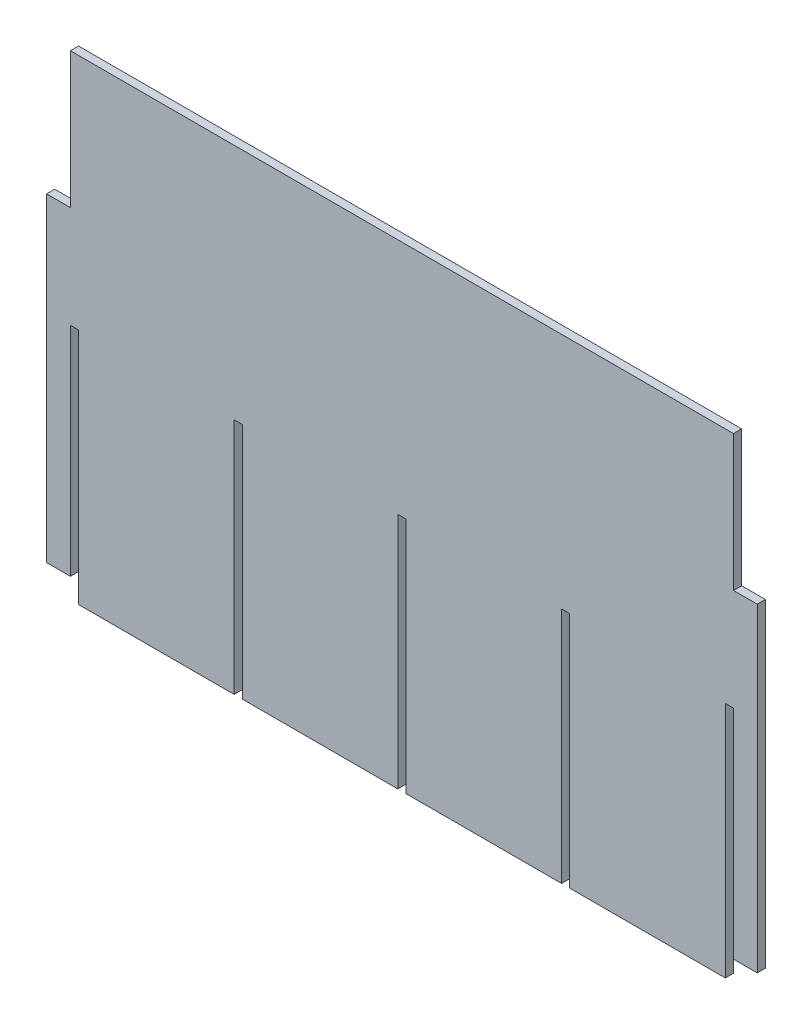
ISO-10303-21;
HEADER;
FILE_DESCRIPTION(('STEP AP214'),'2;1');
FILE_NAME('part.step','',(''),(''),'','','');
FILE_SCHEMA(('AUTOMOTIVE_DESIGN { 1 0 10303 214 1 1 1 1 }'));
ENDSEC;
DATA;
#1=APPLICATION_CONTEXT('core data for automotive mechanical design processes');
#2=APPLICATION_PROTOCOL_DEFINITION('international standard','automotive_design',2000,#1);
#3=PRODUCT_CONTEXT('',#1,'mechanical');
#4=PRODUCT('Part','Part','',(#3));
#5=PRODUCT_RELATED_PRODUCT_CATEGORY('part','',(#4));
#6=PRODUCT_DEFINITION_FORMATION('','',#4);
#7=PRODUCT_DEFINITION_CONTEXT('part definition',#1,'design');
#8=PRODUCT_DEFINITION('design','',#6,#7);
#9=PRODUCT_DEFINITION_SHAPE('','',#8);
#10=(LENGTH_UNIT() NAMED_UNIT(*) SI_UNIT(.MILLI.,.METRE.));
#11=(NAMED_UNIT(*) PLANE_ANGLE_UNIT() SI_UNIT($,.RADIAN.));
#12=(NAMED_UNIT(*) SI_UNIT($,.STERADIAN.) SOLID_ANGLE_UNIT());
#13=UNCERTAINTY_MEASURE_WITH_UNIT(LENGTH_MEASURE(1.E-05),#10,'distance_accuracy_value','');
#14=(GEOMETRIC_REPRESENTATION_CONTEXT(3) GLOBAL_UNCERTAINTY_ASSIGNED_CONTEXT((#13)) GLOBAL_UNIT_ASSIGNED_CONTEXT((#10,
#11,#12)) REPRESENTATION_CONTEXT('',''));
#15=CARTESIAN_POINT('',(0.,0.,0.));
#16=DIRECTION('',(0.,0.,1.));
#17=DIRECTION('',(1.,0.,0.));
#18=AXIS2_PLACEMENT_3D('',#15,#16,#17);
#19=CARTESIAN_POINT('',(-24.7000000000002,32.,0.600000000000572));
#20=DIRECTION('',(0.,1.,0.));
#21=DIRECTION('',(0.,0.,1.));
#22=AXIS2_PLACEMENT_3D('',#19,#20,#21);
#23=PLANE('',#22);
#24=DIRECTION('',(1.,0.,0.));
#25=VECTOR('',#24,1.);
#26=CARTESIAN_POINT('',(-24.7000000000002,32.,-0.599999999999434));
#27=LINE('',#26,#25);
#28=CARTESIAN_POINT('',(-24.7000000000002,32.,-0.599999999999434));
#29=VERTEX_POINT('',#28);
#30=CARTESIAN_POINT('',(-23.5000000000002,32.,-0.599999999999434));
#31=VERTEX_POINT('',#30);
#32=EDGE_CURVE('E262',#29,#31,#27,.T.);
#33=ORIENTED_EDGE('',*,*,#32,.T.);
#34=DIRECTION('',(0.,0.,-1.));
#35=VECTOR('',#34,1.);
#36=CARTESIAN_POINT('',(-23.5000000000002,32.,0.600000000000572));
#37=LINE('',#36,#35);
#38=CARTESIAN_POINT('',(-23.5000000000002,32.,0.600000000000572));
#39=VERTEX_POINT('',#38);
#40=EDGE_CURVE('E11',#39,#31,#37,.T.);
#41=ORIENTED_EDGE('',*,*,#40,.F.);
#42=DIRECTION('',(1.,0.,0.));
#43=VECTOR('',#42,1.);
#44=CARTESIAN_POINT('',(-24.7000000000002,32.,0.600000000000572));
#45=LINE('',#44,#43);
#46=CARTESIAN_POINT('',(-24.7000000000002,32.,0.600000000000572));
#47=VERTEX_POINT('',#46);
#48=EDGE_CURVE('E344',#47,#39,#45,.T.);
#49=ORIENTED_EDGE('',*,*,#48,.F.);
#50=DIRECTION('',(0.,0.,-1.));
#51=VECTOR('',#50,1.);
#52=CARTESIAN_POINT('',(-24.7000000000002,32.,0.600000000000572));
#53=LINE('',#52,#51);
#54=EDGE_CURVE('E258',#47,#29,#53,.T.);
#55=ORIENTED_EDGE('',*,*,#54,.T.);
#56=EDGE_LOOP('',(#33,#41,#49,#55));
#57=FACE_BOUND('',#56,.T.);
#58=ADVANCED_FACE('F40',(#57),#23,.F.);
#59=CARTESIAN_POINT('',(-23.5000000000002,32.,0.600000000000572));
#60=DIRECTION('',(1.,0.,0.));
#61=DIRECTION('',(0.,1.,0.));
#62=AXIS2_PLACEMENT_3D('',#59,#60,#61);
#63=PLANE('',#62);
#64=DIRECTION('',(0.,-1.,0.));
#65=VECTOR('',#64,1.);
#66=CARTESIAN_POINT('',(-23.5000000000002,32.,-0.599999999999434));
#67=LINE('',#66,#65);
#68=CARTESIAN_POINT('',(-23.5000000000002,-3.,-0.599999999999989));
#69=VERTEX_POINT('',#68);
#70=EDGE_CURVE('E266',#31,#69,#67,.T.);
#71=ORIENTED_EDGE('',*,*,#70,.T.);
#72=DIRECTION('',(0.,0.,-1.));
#73=VECTOR('',#72,1.);
#74=CARTESIAN_POINT('',(-23.5000000000002,-3.,0.599999999999989));
#75=LINE('',#74,#73);
#76=CARTESIAN_POINT('',(-23.5000000000002,-3.,0.599999999999989));
#77=VERTEX_POINT('',#76);
#78=EDGE_CURVE('E49',#77,#69,#75,.T.);
#79=ORIENTED_EDGE('',*,*,#78,.F.);
#80=DIRECTION('',(0.,-1.,0.));
#81=VECTOR('',#80,1.);
#82=CARTESIAN_POINT('',(-23.5000000000002,32.,0.600000000000572));
#83=LINE('',#82,#81);
#84=EDGE_CURVE('E160',#39,#77,#83,.T.);
#85=ORIENTED_EDGE('',*,*,#84,.F.);
#86=ORIENTED_EDGE('',*,*,#40,.T.);
#87=EDGE_LOOP('',(#71,#79,#85,#86));
#88=FACE_BOUND('',#87,.T.);
#89=ADVANCED_FACE('F541',(#88),#63,.F.);
#90=CARTESIAN_POINT('',(-23.5000000000002,-3.,0.599999999999989));
#91=DIRECTION('',(0.,1.,0.));
#92=DIRECTION('',(-1.,0.,0.));
#93=AXIS2_PLACEMENT_3D('',#90,#91,#92);
#94=PLANE('',#93);
#95=DIRECTION('',(1.,0.,0.));
#96=VECTOR('',#95,1.);
#97=CARTESIAN_POINT('',(-23.5000000000002,-3.,-0.599999999999989));
#98=LINE('',#97,#96);
#99=CARTESIAN_POINT('',(-0.6,-3.,-0.599999999999989));
#100=VERTEX_POINT('',#99);
#101=EDGE_CURVE('E269',#69,#100,#98,.T.);
#102=ORIENTED_EDGE('',*,*,#101,.T.);
#103=DIRECTION('',(0.,0.,-1.));
#104=VECTOR('',#103,1.);
#105=CARTESIAN_POINT('',(-0.6,-3.,0.599999999999989));
#106=LINE('',#105,#104);
#107=CARTESIAN_POINT('',(-0.6,-3.,0.599999999999989));
#108=VERTEX_POINT('',#107);
#109=EDGE_CURVE('E435',#108,#100,#106,.T.);
#110=ORIENTED_EDGE('',*,*,#109,.F.);
#111=DIRECTION('',(1.,0.,0.));
#112=VECTOR('',#111,1.);
#113=CARTESIAN_POINT('',(-23.5000000000002,-3.,0.599999999999989));
#114=LINE('',#113,#112);
#115=EDGE_CURVE('E447',#77,#108,#114,.T.);
#116=ORIENTED_EDGE('',*,*,#115,.F.);
#117=ORIENTED_EDGE('',*,*,#78,.T.);
#118=EDGE_LOOP('',(#102,#110,#116,#117));
#119=FACE_BOUND('',#118,.T.);
#120=ADVANCED_FACE('F445',(#119),#94,.F.);
#121=CARTESIAN_POINT('',(-0.6,-3.,0.599999999999989));
#122=DIRECTION('',(-1.,0.,0.));
#123=DIRECTION('',(0.,-1.,0.));
#124=AXIS2_PLACEMENT_3D('',#121,#122,#123);
#125=PLANE('',#124);
#126=DIRECTION('',(0.,1.,0.));
#127=VECTOR('',#126,1.);
#128=CARTESIAN_POINT('',(-0.6,-3.,-0.599999999999989));
#129=LINE('',#128,#127);
#130=CARTESIAN_POINT('',(-0.6,32.,-0.599999999999407));
#131=VERTEX_POINT('',#130);
#132=EDGE_CURVE('E272',#100,#131,#129,.T.);
#133=ORIENTED_EDGE('',*,*,#132,.T.);
#134=DIRECTION('',(0.,0.,-1.));
#135=VECTOR('',#134,1.);
#136=CARTESIAN_POINT('',(-0.6,32.,0.600000000000572));
#137=LINE('',#136,#135);
#138=CARTESIAN_POINT('',(-0.6,32.,0.600000000000572));
#139=VERTEX_POINT('',#138);
#140=EDGE_CURVE('E431',#139,#131,#137,.T.);
#141=ORIENTED_EDGE('',*,*,#140,.F.);
#142=DIRECTION('',(0.,1.,0.));
#143=VECTOR('',#142,1.);
#144=CARTESIAN_POINT('',(-0.6,-3.,0.599999999999989));
#145=LINE('',#144,#143);
#146=EDGE_CURVE('E465',#108,#139,#145,.T.);
#147=ORIENTED_EDGE('',*,*,#146,.F.);
#148=ORIENTED_EDGE('',*,*,#109,.T.);
#149=EDGE_LOOP('',(#133,#141,#147,#148));
#150=FACE_BOUND('',#149,.T.);
#151=ADVANCED_FACE('F456',(#150),#125,.F.);
#152=CARTESIAN_POINT('',(-0.6,32.,0.600000000000572));
#153=DIRECTION('',(0.,1.,0.));
#154=DIRECTION('',(0.,0.,1.));
#155=AXIS2_PLACEMENT_3D('',#152,#153,#154);
#156=PLANE('',#155);
#157=DIRECTION('',(1.,0.,0.));
#158=VECTOR('',#157,1.);
#159=CARTESIAN_POINT('',(-0.6,32.,-0.599999999999407));
#160=LINE('',#159,#158);
#161=CARTESIAN_POINT('',(0.600000000000002,32.,-0.599999999999407));
#162=VERTEX_POINT('',#161);
#163=EDGE_CURVE('E275',#131,#162,#160,.T.);
#164=ORIENTED_EDGE('',*,*,#163,.T.);
#165=DIRECTION('',(0.,0.,-1.));
#166=VECTOR('',#165,1.);
#167=CARTESIAN_POINT('',(0.599999999999998,32.,0.600000000000572));
#168=LINE('',#167,#166);
#169=CARTESIAN_POINT('',(0.599999999999998,32.,0.600000000000572));
#170=VERTEX_POINT('',#169);
#171=EDGE_CURVE('E427',#170,#162,#168,.T.);
#172=ORIENTED_EDGE('',*,*,#171,.F.);
#173=DIRECTION('',(1.,0.,0.));
#174=VECTOR('',#173,1.);
#175=CARTESIAN_POINT('',(-0.6,32.,0.600000000000572));
#176=LINE('',#175,#174);
#177=EDGE_CURVE('E462',#139,#170,#176,.T.);
#178=ORIENTED_EDGE('',*,*,#177,.F.);
#179=ORIENTED_EDGE('',*,*,#140,.T.);
#180=EDGE_LOOP('',(#164,#172,#178,#179));
#181=FACE_BOUND('',#180,.T.);
#182=ADVANCED_FACE('F460',(#181),#156,.F.);
#183=CARTESIAN_POINT('',(0.599999999999998,32.,0.600000000000572));
#184=DIRECTION('',(1.,0.,0.));
#185=DIRECTION('',(0.,1.,0.));
#186=AXIS2_PLACEMENT_3D('',#183,#184,#185);
#187=PLANE('',#186);
#188=DIRECTION('',(0.,-1.,0.));
#189=VECTOR('',#188,1.);
#190=CARTESIAN_POINT('',(0.600000000000002,32.,-0.599999999999407));
#191=LINE('',#190,#189);
#192=CARTESIAN_POINT('',(0.599999999999998,-2.99999999999995,-0.599999999999989));
#193=VERTEX_POINT('',#192);
#194=EDGE_CURVE('E278',#162,#193,#191,.T.);
#195=ORIENTED_EDGE('',*,*,#194,.T.);
#196=DIRECTION('',(0.,0.,-1.));
#197=VECTOR('',#196,1.);
#198=CARTESIAN_POINT('',(0.599999999999994,-2.99999999999995,0.599999999999989));
#199=LINE('',#198,#197);
#200=CARTESIAN_POINT('',(0.599999999999994,-2.99999999999995,0.599999999999989));
#201=VERTEX_POINT('',#200);
#202=EDGE_CURVE('E423',#201,#193,#199,.T.);
#203=ORIENTED_EDGE('',*,*,#202,.F.);
#204=DIRECTION('',(0.,-1.,0.));
#205=VECTOR('',#204,1.);
#206=CARTESIAN_POINT('',(0.599999999999998,32.,0.600000000000572));
#207=LINE('',#206,#205);
#208=EDGE_CURVE('E464',#170,#201,#207,.T.);
#209=ORIENTED_EDGE('',*,*,#208,.F.);
#210=ORIENTED_EDGE('',*,*,#171,.T.);
#211=EDGE_LOOP('',(#195,#203,#209,#210));
#212=FACE_BOUND('',#211,.T.);
#213=ADVANCED_FACE('F553',(#212),#187,.F.);
#214=CARTESIAN_POINT('',(0.599999999999994,-2.99999999999995,0.599999999999989));
#215=DIRECTION('',(0.,1.,0.));
#216=DIRECTION('',(-1.,0.,0.));
#217=AXIS2_PLACEMENT_3D('',#214,#215,#216);
#218=PLANE('',#217);
#219=DIRECTION('',(1.,0.,0.));
#220=VECTOR('',#219,1.);
#221=CARTESIAN_POINT('',(0.599999999999998,-2.99999999999995,-0.599999999999989));
#222=LINE('',#221,#220);
#223=CARTESIAN_POINT('',(23.4999999999999,-3.,-0.599999999999989));
#224=VERTEX_POINT('',#223);
#225=EDGE_CURVE('E281',#193,#224,#222,.T.);
#226=ORIENTED_EDGE('',*,*,#225,.T.);
#227=DIRECTION('',(0.,0.,-1.));
#228=VECTOR('',#227,1.);
#229=CARTESIAN_POINT('',(23.4999999999999,-3.,0.599999999999989));
#230=LINE('',#229,#228);
#231=CARTESIAN_POINT('',(23.4999999999999,-3.,0.599999999999989));
#232=VERTEX_POINT('',#231);
#233=EDGE_CURVE('E419',#232,#224,#230,.T.);
#234=ORIENTED_EDGE('',*,*,#233,.F.);
#235=DIRECTION('',(1.,0.,0.));
#236=VECTOR('',#235,1.);
#237=CARTESIAN_POINT('',(0.599999999999994,-2.99999999999995,0.599999999999989));
#238=LINE('',#237,#236);
#239=EDGE_CURVE('E469',#201,#232,#238,.T.);
#240=ORIENTED_EDGE('',*,*,#239,.F.);
#241=ORIENTED_EDGE('',*,*,#202,.T.);
#242=EDGE_LOOP('',(#226,#234,#240,#241));
#243=FACE_BOUND('',#242,.T.);
#244=ADVANCED_FACE('F556',(#243),#218,.F.);
#245=CARTESIAN_POINT('',(23.4999999999999,-3.,0.599999999999989));
#246=DIRECTION('',(-1.,0.,0.));
#247=DIRECTION('',(0.,-1.,0.));
#248=AXIS2_PLACEMENT_3D('',#245,#246,#247);
#249=PLANE('',#248);
#250=DIRECTION('',(0.,1.,0.));
#251=VECTOR('',#250,1.);
#252=CARTESIAN_POINT('',(23.4999999999999,-3.,-0.599999999999989));
#253=LINE('',#252,#251);
#254=CARTESIAN_POINT('',(23.4999999999999,32.,-0.599999999999407));
#255=VERTEX_POINT('',#254);
#256=EDGE_CURVE('E284',#224,#255,#253,.T.);
#257=ORIENTED_EDGE('',*,*,#256,.T.);
#258=DIRECTION('',(0.,0.,-1.));
#259=VECTOR('',#258,1.);
#260=CARTESIAN_POINT('',(23.4999999999999,32.,0.600000000000572));
#261=LINE('',#260,#259);
#262=CARTESIAN_POINT('',(23.4999999999999,32.,0.600000000000572));
#263=VERTEX_POINT('',#262);
#264=EDGE_CURVE('E415',#263,#255,#261,.T.);
#265=ORIENTED_EDGE('',*,*,#264,.F.);
#266=DIRECTION('',(0.,1.,0.));
#267=VECTOR('',#266,1.);
#268=CARTESIAN_POINT('',(23.4999999999999,-3.,0.599999999999989));
#269=LINE('',#268,#267);
#270=EDGE_CURVE('E477',#232,#263,#269,.T.);
#271=ORIENTED_EDGE('',*,*,#270,.F.);
#272=ORIENTED_EDGE('',*,*,#233,.T.);
#273=EDGE_LOOP('',(#257,#265,#271,#272));
#274=FACE_BOUND('',#273,.T.);
#275=ADVANCED_FACE('F560',(#274),#249,.F.);
#276=CARTESIAN_POINT('',(23.4999999999999,32.,0.600000000000572));
#277=DIRECTION('',(0.,1.,0.));
#278=DIRECTION('',(-1.,0.,0.));
#279=AXIS2_PLACEMENT_3D('',#276,#277,#278);
#280=PLANE('',#279);
#281=DIRECTION('',(1.,0.,0.));
#282=VECTOR('',#281,1.);
#283=CARTESIAN_POINT('',(23.4999999999999,32.,-0.599999999999407));
#284=LINE('',#283,#282);
#285=CARTESIAN_POINT('',(24.6999999999999,32.0000000000002,-0.599999999999407));
#286=VERTEX_POINT('',#285);
#287=EDGE_CURVE('E287',#255,#286,#284,.T.);
#288=ORIENTED_EDGE('',*,*,#287,.T.);
#289=DIRECTION('',(0.,0.,-1.));
#290=VECTOR('',#289,1.);
#291=CARTESIAN_POINT('',(24.6999999999999,32.0000000000002,0.600000000000572));
#292=LINE('',#291,#290);
#293=CARTESIAN_POINT('',(24.6999999999999,32.0000000000002,0.600000000000572));
#294=VERTEX_POINT('',#293);
#295=EDGE_CURVE('E411',#294,#286,#292,.T.);
#296=ORIENTED_EDGE('',*,*,#295,.F.);
#297=DIRECTION('',(1.,0.,0.));
#298=VECTOR('',#297,1.);
#299=CARTESIAN_POINT('',(23.4999999999999,32.,0.600000000000572));
#300=LINE('',#299,#298);
#301=EDGE_CURVE('E480',#263,#294,#300,.T.);
#302=ORIENTED_EDGE('',*,*,#301,.F.);
#303=ORIENTED_EDGE('',*,*,#264,.T.);
#304=EDGE_LOOP('',(#288,#296,#302,#303));
#305=FACE_BOUND('',#304,.T.);
#306=ADVANCED_FACE('F564',(#305),#280,.F.);
#307=CARTESIAN_POINT('',(24.6999999999999,32.0000000000002,0.600000000000572));
#308=DIRECTION('',(1.,0.,0.));
#309=DIRECTION('',(0.,1.,0.));
#310=AXIS2_PLACEMENT_3D('',#307,#308,#309);
#311=PLANE('',#310);
#312=DIRECTION('',(0.,-1.,0.));
#313=VECTOR('',#312,1.);
#314=CARTESIAN_POINT('',(24.6999999999999,32.0000000000002,-0.599999999999407));
#315=LINE('',#314,#313);
#316=CARTESIAN_POINT('',(24.6999999999999,-2.99999999999934,-0.599999999999989));
#317=VERTEX_POINT('',#316);
#318=EDGE_CURVE('E290',#286,#317,#315,.T.);
#319=ORIENTED_EDGE('',*,*,#318,.T.);
#320=DIRECTION('',(0.,0.,-1.));
#321=VECTOR('',#320,1.);
#322=CARTESIAN_POINT('',(24.6999999999999,-2.99999999999934,0.599999999999989));
#323=LINE('',#322,#321);
#324=CARTESIAN_POINT('',(24.6999999999999,-2.99999999999934,0.599999999999989));
#325=VERTEX_POINT('',#324);
#326=EDGE_CURVE('E407',#325,#317,#323,.T.);
#327=ORIENTED_EDGE('',*,*,#326,.F.);
#328=DIRECTION('',(0.,-1.,0.));
#329=VECTOR('',#328,1.);
#330=CARTESIAN_POINT('',(24.6999999999999,32.0000000000002,0.600000000000572));
#331=LINE('',#330,#329);
#332=EDGE_CURVE('E483',#294,#325,#331,.T.);
#333=ORIENTED_EDGE('',*,*,#332,.F.);
#334=ORIENTED_EDGE('',*,*,#295,.T.);
#335=EDGE_LOOP('',(#319,#327,#333,#334));
#336=FACE_BOUND('',#335,.T.);
#337=ADVANCED_FACE('F568',(#336),#311,.F.);
#338=CARTESIAN_POINT('',(24.6999999999999,-2.99999999999934,0.599999999999989));
#339=DIRECTION('',(0.,1.,0.));
#340=DIRECTION('',(-1.,0.,0.));
#341=AXIS2_PLACEMENT_3D('',#338,#339,#340);
#342=PLANE('',#341);
#343=DIRECTION('',(1.,0.,0.));
#344=VECTOR('',#343,1.);
#345=CARTESIAN_POINT('',(24.6999999999999,-2.99999999999934,-0.599999999999989));
#346=LINE('',#345,#344);
#347=CARTESIAN_POINT('',(47.5999999999999,-3.,-0.599999999999989));
#348=VERTEX_POINT('',#347);
#349=EDGE_CURVE('E293',#317,#348,#346,.T.);
#350=ORIENTED_EDGE('',*,*,#349,.T.);
#351=DIRECTION('',(0.,0.,-1.));
#352=VECTOR('',#351,1.);
#353=CARTESIAN_POINT('',(47.5999999999999,-3.,0.600000000000017));
#354=LINE('',#353,#352);
#355=CARTESIAN_POINT('',(47.5999999999999,-3.,0.600000000000017));
#356=VERTEX_POINT('',#355);
#357=EDGE_CURVE('E403',#356,#348,#354,.T.);
#358=ORIENTED_EDGE('',*,*,#357,.F.);
#359=DIRECTION('',(1.,0.,0.));
#360=VECTOR('',#359,1.);
#361=CARTESIAN_POINT('',(24.6999999999999,-2.99999999999934,0.599999999999989));
#362=LINE('',#361,#360);
#363=EDGE_CURVE('E486',#325,#356,#362,.T.);
#364=ORIENTED_EDGE('',*,*,#363,.F.);
#365=ORIENTED_EDGE('',*,*,#326,.T.);
#366=EDGE_LOOP('',(#350,#358,#364,#365));
#367=FACE_BOUND('',#366,.T.);
#368=ADVANCED_FACE('F572',(#367),#342,.F.);
#369=CARTESIAN_POINT('',(47.5999999999999,-3.,0.600000000000017));
#370=DIRECTION('',(-1.,0.,0.));
#371=DIRECTION('',(0.,0.,1.));
#372=AXIS2_PLACEMENT_3D('',#369,#370,#371);
#373=PLANE('',#372);
#374=DIRECTION('',(0.,1.,0.));
#375=VECTOR('',#374,1.);
#376=CARTESIAN_POINT('',(47.5999999999999,-3.,-0.599999999999989));
#377=LINE('',#376,#375);
#378=CARTESIAN_POINT('',(47.5999999999999,32.,-0.599999999999407));
#379=VERTEX_POINT('',#378);
#380=EDGE_CURVE('E296',#348,#379,#377,.T.);
#381=ORIENTED_EDGE('',*,*,#380,.T.);
#382=DIRECTION('',(0.,0.,-1.));
#383=VECTOR('',#382,1.);
#384=CARTESIAN_POINT('',(47.5999999999999,32.,0.600000000000572));
#385=LINE('',#384,#383);
#386=CARTESIAN_POINT('',(47.5999999999999,32.,0.600000000000572));
#387=VERTEX_POINT('',#386);
#388=EDGE_CURVE('E399',#387,#379,#385,.T.);
#389=ORIENTED_EDGE('',*,*,#388,.F.);
#390=DIRECTION('',(0.,1.,0.));
#391=VECTOR('',#390,1.);
#392=CARTESIAN_POINT('',(47.5999999999999,-3.,0.600000000000017));
#393=LINE('',#392,#391);
#394=EDGE_CURVE('E489',#356,#387,#393,.T.);
#395=ORIENTED_EDGE('',*,*,#394,.F.);
#396=ORIENTED_EDGE('',*,*,#357,.T.);
#397=EDGE_LOOP('',(#381,#389,#395,#396));
#398=FACE_BOUND('',#397,.T.);
#399=ADVANCED_FACE('F576',(#398),#373,.F.);
#400=CARTESIAN_POINT('',(48.8,32.0000000000001,0.600000000000572));
#401=DIRECTION('',(0.,1.,0.));
#402=DIRECTION('',(0.,0.,1.));
#403=AXIS2_PLACEMENT_3D('',#400,#401,#402);
#404=PLANE('',#403);
#405=DIRECTION('',(1.,0.,0.));
#406=VECTOR('',#405,1.);
#407=CARTESIAN_POINT('',(48.8,32.0000000000001,-0.599999999999407));
#408=LINE('',#407,#406);
#409=CARTESIAN_POINT('',(48.8,32.0000000000001,-0.599999999999407));
#410=VERTEX_POINT('',#409);
#411=EDGE_CURVE('E299',#379,#410,#408,.T.);
#412=ORIENTED_EDGE('',*,*,#411,.T.);
#413=DIRECTION('',(0.,0.,-1.));
#414=VECTOR('',#413,1.);
#415=CARTESIAN_POINT('',(48.8,32.0000000000001,0.600000000000572));
#416=LINE('',#415,#414);
#417=CARTESIAN_POINT('',(48.8,32.0000000000001,0.600000000000572));
#418=VERTEX_POINT('',#417);
#419=EDGE_CURVE('E395',#418,#410,#416,.T.);
#420=ORIENTED_EDGE('',*,*,#419,.F.);
#421=DIRECTION('',(1.,0.,0.));
#422=VECTOR('',#421,1.);
#423=CARTESIAN_POINT('',(48.8,32.0000000000001,0.600000000000572));
#424=LINE('',#423,#422);
#425=EDGE_CURVE('E492',#387,#418,#424,.T.);
#426=ORIENTED_EDGE('',*,*,#425,.F.);
#427=ORIENTED_EDGE('',*,*,#388,.T.);
#428=EDGE_LOOP('',(#412,#420,#426,#427));
#429=FACE_BOUND('',#428,.T.);
#430=ADVANCED_FACE('F580',(#429),#404,.F.);
#431=CARTESIAN_POINT('',(48.7999999999998,8.32667268468867E-13,0.600000000000017));
#432=DIRECTION('',(1.,0.,0.));
#433=DIRECTION('',(0.,0.,-1.));
#434=AXIS2_PLACEMENT_3D('',#431,#432,#433);
#435=PLANE('',#434);
#436=DIRECTION('',(0.,-1.,0.));
#437=VECTOR('',#436,1.);
#438=CARTESIAN_POINT('',(48.7999999999998,8.32667268468867E-13,-0.599999999999989));
#439=LINE('',#438,#437);
#440=CARTESIAN_POINT('',(48.7999999999998,8.32667268468867E-13,-0.599999999999989));
#441=VERTEX_POINT('',#440);
#442=EDGE_CURVE('E302',#410,#441,#439,.T.);
#443=ORIENTED_EDGE('',*,*,#442,.T.);
#444=DIRECTION('',(0.,0.,-1.));
#445=VECTOR('',#444,1.);
#446=CARTESIAN_POINT('',(48.7999999999998,8.32667268468867E-13,0.600000000000017));
#447=LINE('',#446,#445);
#448=CARTESIAN_POINT('',(48.7999999999998,8.32667268468867E-13,0.600000000000017));
#449=VERTEX_POINT('',#448);
#450=EDGE_CURVE('E391',#449,#441,#447,.T.);
#451=ORIENTED_EDGE('',*,*,#450,.F.);
#452=DIRECTION('',(0.,-1.,0.));
#453=VECTOR('',#452,1.);
#454=CARTESIAN_POINT('',(48.7999999999998,8.32667268468867E-13,0.600000000000017));
#455=LINE('',#454,#453);
#456=EDGE_CURVE('E495',#418,#449,#455,.T.);
#457=ORIENTED_EDGE('',*,*,#456,.F.);
#458=ORIENTED_EDGE('',*,*,#419,.T.);
#459=EDGE_LOOP('',(#443,#451,#457,#458));
#460=FACE_BOUND('',#459,.T.);
#461=ADVANCED_FACE('F584',(#460),#435,.F.);
#462=CARTESIAN_POINT('',(52.2999999999998,0.,0.600000000000017));
#463=DIRECTION('',(0.,1.,0.));
#464=DIRECTION('',(-1.,0.,0.));
#465=AXIS2_PLACEMENT_3D('',#462,#463,#464);
#466=PLANE('',#465);
#467=DIRECTION('',(1.,0.,0.));
#468=VECTOR('',#467,1.);
#469=CARTESIAN_POINT('',(52.2999999999998,0.,-0.599999999999989));
#470=LINE('',#469,#468);
#471=CARTESIAN_POINT('',(52.2999999999998,0.,-0.599999999999989));
#472=VERTEX_POINT('',#471);
#473=EDGE_CURVE('E305',#441,#472,#470,.T.);
#474=ORIENTED_EDGE('',*,*,#473,.T.);
#475=DIRECTION('',(0.,0.,-1.));
#476=VECTOR('',#475,1.);
#477=CARTESIAN_POINT('',(52.2999999999998,0.,0.600000000000017));
#478=LINE('',#477,#476);
#479=CARTESIAN_POINT('',(52.2999999999998,0.,0.600000000000017));
#480=VERTEX_POINT('',#479);
#481=EDGE_CURVE('E387',#480,#472,#478,.T.);
#482=ORIENTED_EDGE('',*,*,#481,.F.);
#483=DIRECTION('',(1.,0.,0.));
#484=VECTOR('',#483,1.);
#485=CARTESIAN_POINT('',(52.2999999999998,0.,0.600000000000017));
#486=LINE('',#485,#484);
#487=EDGE_CURVE('E498',#449,#480,#486,.T.);
#488=ORIENTED_EDGE('',*,*,#487,.F.);
#489=ORIENTED_EDGE('',*,*,#450,.T.);
#490=EDGE_LOOP('',(#474,#482,#488,#489));
#491=FACE_BOUND('',#490,.T.);
#492=ADVANCED_FACE('F588',(#491),#466,.F.);
#493=CARTESIAN_POINT('',(52.2999999999999,47.,0.600000000000572));
#494=DIRECTION('',(-1.,0.,0.));
#495=DIRECTION('',(0.,-1.,0.));
#496=AXIS2_PLACEMENT_3D('',#493,#494,#495);
#497=PLANE('',#496);
#498=DIRECTION('',(0.,1.,0.));
#499=VECTOR('',#498,1.);
#500=CARTESIAN_POINT('',(52.2999999999999,47.,-0.599999999999407));
#501=LINE('',#500,#499);
#502=CARTESIAN_POINT('',(52.2999999999999,47.,-0.599999999999407));
#503=VERTEX_POINT('',#502);
#504=EDGE_CURVE('E308',#472,#503,#501,.T.);
#505=ORIENTED_EDGE('',*,*,#504,.T.);
#506=DIRECTION('',(0.,0.,-1.));
#507=VECTOR('',#506,1.);
#508=CARTESIAN_POINT('',(52.2999999999999,47.,0.600000000000572));
#509=LINE('',#508,#507);
#510=CARTESIAN_POINT('',(52.2999999999999,47.,0.600000000000572));
#511=VERTEX_POINT('',#510);
#512=EDGE_CURVE('E383',#511,#503,#509,.T.);
#513=ORIENTED_EDGE('',*,*,#512,.F.);
#514=DIRECTION('',(0.,1.,0.));
#515=VECTOR('',#514,1.);
#516=CARTESIAN_POINT('',(52.2999999999999,47.,0.600000000000572));
#517=LINE('',#516,#515);
#518=EDGE_CURVE('E501',#480,#511,#517,.T.);
#519=ORIENTED_EDGE('',*,*,#518,.F.);
#520=ORIENTED_EDGE('',*,*,#481,.T.);
#521=EDGE_LOOP('',(#505,#513,#519,#520));
#522=FACE_BOUND('',#521,.T.);
#523=ADVANCED_FACE('F592',(#522),#497,.F.);
#524=CARTESIAN_POINT('',(48.8,47.0000000000002,0.600000000000572));
#525=DIRECTION('',(0.,-1.,0.));
#526=DIRECTION('',(0.,0.,-1.));
#527=AXIS2_PLACEMENT_3D('',#524,#525,#526);
#528=PLANE('',#527);
#529=DIRECTION('',(-1.,0.,0.));
#530=VECTOR('',#529,1.);
#531=CARTESIAN_POINT('',(48.8,47.0000000000002,-0.599999999999407));
#532=LINE('',#531,#530);
#533=CARTESIAN_POINT('',(48.8,47.0000000000002,-0.599999999999407));
#534=VERTEX_POINT('',#533);
#535=EDGE_CURVE('E311',#503,#534,#532,.T.);
#536=ORIENTED_EDGE('',*,*,#535,.T.);
#537=DIRECTION('',(0.,0.,-1.));
#538=VECTOR('',#537,1.);
#539=CARTESIAN_POINT('',(48.8,47.0000000000002,0.600000000000572));
#540=LINE('',#539,#538);
#541=CARTESIAN_POINT('',(48.8,47.0000000000002,0.600000000000572));
#542=VERTEX_POINT('',#541);
#543=EDGE_CURVE('E379',#542,#534,#540,.T.);
#544=ORIENTED_EDGE('',*,*,#543,.F.);
#545=DIRECTION('',(-1.,0.,0.));
#546=VECTOR('',#545,1.);
#547=CARTESIAN_POINT('',(48.8,47.0000000000002,0.600000000000572));
#548=LINE('',#547,#546);
#549=EDGE_CURVE('E504',#511,#542,#548,.T.);
#550=ORIENTED_EDGE('',*,*,#549,.F.);
#551=ORIENTED_EDGE('',*,*,#512,.T.);
#552=EDGE_LOOP('',(#536,#544,#550,#551));
#553=FACE_BOUND('',#552,.T.);
#554=ADVANCED_FACE('F596',(#553),#528,.F.);
#555=CARTESIAN_POINT('',(48.7999999999999,67.0000000000002,0.600000000000572));
#556=DIRECTION('',(-1.,0.,0.));
#557=DIRECTION('',(0.,-1.,0.));
#558=AXIS2_PLACEMENT_3D('',#555,#556,#557);
#559=PLANE('',#558);
#560=DIRECTION('',(0.,1.,0.));
#561=VECTOR('',#560,1.);
#562=CARTESIAN_POINT('',(48.7999999999999,67.0000000000002,-0.599999999999407));
#563=LINE('',#562,#561);
#564=CARTESIAN_POINT('',(48.7999999999999,67.0000000000002,-0.599999999999407));
#565=VERTEX_POINT('',#564);
#566=EDGE_CURVE('E314',#534,#565,#563,.T.);
#567=ORIENTED_EDGE('',*,*,#566,.T.);
#568=DIRECTION('',(0.,0.,-1.));
#569=VECTOR('',#568,1.);
#570=CARTESIAN_POINT('',(48.7999999999999,67.0000000000002,0.600000000000572));
#571=LINE('',#570,#569);
#572=CARTESIAN_POINT('',(48.7999999999999,67.0000000000002,0.600000000000572));
#573=VERTEX_POINT('',#572);
#574=EDGE_CURVE('E375',#573,#565,#571,.T.);
#575=ORIENTED_EDGE('',*,*,#574,.F.);
#576=DIRECTION('',(0.,1.,0.));
#577=VECTOR('',#576,1.);
#578=CARTESIAN_POINT('',(48.7999999999999,67.0000000000002,0.600000000000572));
#579=LINE('',#578,#577);
#580=EDGE_CURVE('E507',#542,#573,#579,.T.);
#581=ORIENTED_EDGE('',*,*,#580,.F.);
#582=ORIENTED_EDGE('',*,*,#543,.T.);
#583=EDGE_LOOP('',(#567,#575,#581,#582));
#584=FACE_BOUND('',#583,.T.);
#585=ADVANCED_FACE('F600',(#584),#559,.F.);
#586=CARTESIAN_POINT('',(-48.8000000000001,67.0000000000001,0.600000000000572));
#587=DIRECTION('',(0.,-1.,0.));
#588=DIRECTION('',(0.,0.,-1.));
#589=AXIS2_PLACEMENT_3D('',#586,#587,#588);
#590=PLANE('',#589);
#591=DIRECTION('',(-1.,0.,0.));
#592=VECTOR('',#591,1.);
#593=CARTESIAN_POINT('',(-48.8000000000001,67.0000000000001,-0.599999999999434));
#594=LINE('',#593,#592);
#595=CARTESIAN_POINT('',(-48.8000000000001,67.0000000000001,-0.599999999999434));
#596=VERTEX_POINT('',#595);
#597=EDGE_CURVE('E317',#565,#596,#594,.T.);
#598=ORIENTED_EDGE('',*,*,#597,.T.);
#599=DIRECTION('',(0.,0.,-1.));
#600=VECTOR('',#599,1.);
#601=CARTESIAN_POINT('',(-48.8000000000001,67.0000000000001,0.600000000000572));
#602=LINE('',#601,#600);
#603=CARTESIAN_POINT('',(-48.8000000000001,67.0000000000001,0.600000000000572));
#604=VERTEX_POINT('',#603);
#605=EDGE_CURVE('E371',#604,#596,#602,.T.);
#606=ORIENTED_EDGE('',*,*,#605,.F.);
#607=DIRECTION('',(-1.,0.,0.));
#608=VECTOR('',#607,1.);
#609=CARTESIAN_POINT('',(-48.8000000000001,67.0000000000001,0.600000000000572));
#610=LINE('',#609,#608);
#611=EDGE_CURVE('E510',#573,#604,#610,.T.);
#612=ORIENTED_EDGE('',*,*,#611,.F.);
#613=ORIENTED_EDGE('',*,*,#574,.T.);
#614=EDGE_LOOP('',(#598,#606,#612,#613));
#615=FACE_BOUND('',#614,.T.);
#616=ADVANCED_FACE('F604',(#615),#590,.F.);
#617=CARTESIAN_POINT('',(-48.8,47.0000000000001,0.600000000000572));
#618=DIRECTION('',(1.,0.,0.));
#619=DIRECTION('',(0.,0.,-1.));
#620=AXIS2_PLACEMENT_3D('',#617,#618,#619);
#621=PLANE('',#620);
#622=DIRECTION('',(0.,-1.,0.));
#623=VECTOR('',#622,1.);
#624=CARTESIAN_POINT('',(-48.8,47.0000000000001,-0.599999999999434));
#625=LINE('',#624,#623);
#626=CARTESIAN_POINT('',(-48.8,47.0000000000001,-0.599999999999434));
#627=VERTEX_POINT('',#626);
#628=EDGE_CURVE('E320',#596,#627,#625,.T.);
#629=ORIENTED_EDGE('',*,*,#628,.T.);
#630=DIRECTION('',(0.,0.,-1.));
#631=VECTOR('',#630,1.);
#632=CARTESIAN_POINT('',(-48.8,47.0000000000001,0.600000000000572));
#633=LINE('',#632,#631);
#634=CARTESIAN_POINT('',(-48.8,47.0000000000001,0.600000000000572));
#635=VERTEX_POINT('',#634);
#636=EDGE_CURVE('E367',#635,#627,#633,.T.);
#637=ORIENTED_EDGE('',*,*,#636,.F.);
#638=DIRECTION('',(0.,-1.,0.));
#639=VECTOR('',#638,1.);
#640=CARTESIAN_POINT('',(-48.8,47.0000000000001,0.600000000000572));
#641=LINE('',#640,#639);
#642=EDGE_CURVE('E513',#604,#635,#641,.T.);
#643=ORIENTED_EDGE('',*,*,#642,.F.);
#644=ORIENTED_EDGE('',*,*,#605,.T.);
#645=EDGE_LOOP('',(#629,#637,#643,#644));
#646=FACE_BOUND('',#645,.T.);
#647=ADVANCED_FACE('F608',(#646),#621,.F.);
#648=CARTESIAN_POINT('',(-52.3,47.,0.600000000000572));
#649=DIRECTION('',(0.,-1.,0.));
#650=DIRECTION('',(0.,0.,-1.));
#651=AXIS2_PLACEMENT_3D('',#648,#649,#650);
#652=PLANE('',#651);
#653=DIRECTION('',(-1.,0.,0.));
#654=VECTOR('',#653,1.);
#655=CARTESIAN_POINT('',(-52.3,47.,-0.599999999999434));
#656=LINE('',#655,#654);
#657=CARTESIAN_POINT('',(-52.3,47.,-0.599999999999434));
#658=VERTEX_POINT('',#657);
#659=EDGE_CURVE('E323',#627,#658,#656,.T.);
#660=ORIENTED_EDGE('',*,*,#659,.T.);
#661=DIRECTION('',(0.,0.,-1.));
#662=VECTOR('',#661,1.);
#663=CARTESIAN_POINT('',(-52.3,47.,0.600000000000572));
#664=LINE('',#663,#662);
#665=CARTESIAN_POINT('',(-52.3,47.,0.600000000000572));
#666=VERTEX_POINT('',#665);
#667=EDGE_CURVE('E363',#666,#658,#664,.T.);
#668=ORIENTED_EDGE('',*,*,#667,.F.);
#669=DIRECTION('',(-1.,0.,0.));
#670=VECTOR('',#669,1.);
#671=CARTESIAN_POINT('',(-52.3,47.,0.600000000000572));
#672=LINE('',#671,#670);
#673=EDGE_CURVE('E516',#635,#666,#672,.T.);
#674=ORIENTED_EDGE('',*,*,#673,.F.);
#675=ORIENTED_EDGE('',*,*,#636,.T.);
#676=EDGE_LOOP('',(#660,#668,#674,#675));
#677=FACE_BOUND('',#676,.T.);
#678=ADVANCED_FACE('F612',(#677),#652,.F.);
#679=CARTESIAN_POINT('',(-52.3000000000001,0.,0.599999999999989));
#680=DIRECTION('',(1.,0.,0.));
#681=DIRECTION('',(0.,0.,-1.));
#682=AXIS2_PLACEMENT_3D('',#679,#680,#681);
#683=PLANE('',#682);
#684=DIRECTION('',(0.,-1.,0.));
#685=VECTOR('',#684,1.);
#686=CARTESIAN_POINT('',(-52.3000000000001,0.,-0.600000000000017));
#687=LINE('',#686,#685);
#688=CARTESIAN_POINT('',(-52.3000000000001,0.,-0.600000000000017));
#689=VERTEX_POINT('',#688);
#690=EDGE_CURVE('E326',#658,#689,#687,.T.);
#691=ORIENTED_EDGE('',*,*,#690,.T.);
#692=DIRECTION('',(0.,0.,-1.));
#693=VECTOR('',#692,1.);
#694=CARTESIAN_POINT('',(-52.3000000000001,0.,0.599999999999989));
#695=LINE('',#694,#693);
#696=CARTESIAN_POINT('',(-52.3000000000001,0.,0.599999999999989));
#697=VERTEX_POINT('',#696);
#698=EDGE_CURVE('E359',#697,#689,#695,.T.);
#699=ORIENTED_EDGE('',*,*,#698,.F.);
#700=DIRECTION('',(0.,-1.,0.));
#701=VECTOR('',#700,1.);
#702=CARTESIAN_POINT('',(-52.3000000000001,0.,0.599999999999989));
#703=LINE('',#702,#701);
#704=EDGE_CURVE('E519',#666,#697,#703,.T.);
#705=ORIENTED_EDGE('',*,*,#704,.F.);
#706=ORIENTED_EDGE('',*,*,#667,.T.);
#707=EDGE_LOOP('',(#691,#699,#705,#706));
#708=FACE_BOUND('',#707,.T.);
#709=ADVANCED_FACE('F616',(#708),#683,.F.);
#710=CARTESIAN_POINT('',(-48.8000000000001,0.,0.599999999999989));
#711=DIRECTION('',(0.,1.,0.));
#712=DIRECTION('',(-1.,0.,0.));
#713=AXIS2_PLACEMENT_3D('',#710,#711,#712);
#714=PLANE('',#713);
#715=DIRECTION('',(1.,0.,0.));
#716=VECTOR('',#715,1.);
#717=CARTESIAN_POINT('',(-48.8000000000001,0.,-0.600000000000017));
#718=LINE('',#717,#716);
#719=CARTESIAN_POINT('',(-48.8000000000001,0.,-0.600000000000017));
#720=VERTEX_POINT('',#719);
#721=EDGE_CURVE('E329',#689,#720,#718,.T.);
#722=ORIENTED_EDGE('',*,*,#721,.T.);
#723=DIRECTION('',(0.,0.,-1.));
#724=VECTOR('',#723,1.);
#725=CARTESIAN_POINT('',(-48.8000000000001,0.,0.599999999999989));
#726=LINE('',#725,#724);
#727=CARTESIAN_POINT('',(-48.8000000000001,0.,0.599999999999989));
#728=VERTEX_POINT('',#727);
#729=EDGE_CURVE('E355',#728,#720,#726,.T.);
#730=ORIENTED_EDGE('',*,*,#729,.F.);
#731=DIRECTION('',(1.,0.,0.));
#732=VECTOR('',#731,1.);
#733=CARTESIAN_POINT('',(-48.8000000000001,0.,0.599999999999989));
#734=LINE('',#733,#732);
#735=EDGE_CURVE('E522',#697,#728,#734,.T.);
#736=ORIENTED_EDGE('',*,*,#735,.F.);
#737=ORIENTED_EDGE('',*,*,#698,.T.);
#738=EDGE_LOOP('',(#722,#730,#736,#737));
#739=FACE_BOUND('',#738,.T.);
#740=ADVANCED_FACE('F620',(#739),#714,.F.);
#741=CARTESIAN_POINT('',(-48.8,32.0000000000002,0.600000000000572));
#742=DIRECTION('',(-1.,0.,0.));
#743=DIRECTION('',(0.,0.,1.));
#744=AXIS2_PLACEMENT_3D('',#741,#742,#743);
#745=PLANE('',#744);
#746=DIRECTION('',(0.,1.,0.));
#747=VECTOR('',#746,1.);
#748=CARTESIAN_POINT('',(-48.8,32.0000000000002,-0.599999999999434));
#749=LINE('',#748,#747);
#750=CARTESIAN_POINT('',(-48.8,32.0000000000002,-0.599999999999434));
#751=VERTEX_POINT('',#750);
#752=EDGE_CURVE('E332',#720,#751,#749,.T.);
#753=ORIENTED_EDGE('',*,*,#752,.T.);
#754=DIRECTION('',(0.,0.,-1.));
#755=VECTOR('',#754,1.);
#756=CARTESIAN_POINT('',(-48.8,32.0000000000002,0.600000000000572));
#757=LINE('',#756,#755);
#758=CARTESIAN_POINT('',(-48.8,32.0000000000002,0.600000000000572));
#759=VERTEX_POINT('',#758);
#760=EDGE_CURVE('E351',#759,#751,#757,.T.);
#761=ORIENTED_EDGE('',*,*,#760,.F.);
#762=DIRECTION('',(0.,1.,0.));
#763=VECTOR('',#762,1.);
#764=CARTESIAN_POINT('',(-48.8,32.0000000000002,0.600000000000572));
#765=LINE('',#764,#763);
#766=EDGE_CURVE('E525',#728,#759,#765,.T.);
#767=ORIENTED_EDGE('',*,*,#766,.F.);
#768=ORIENTED_EDGE('',*,*,#729,.T.);
#769=EDGE_LOOP('',(#753,#761,#767,#768));
#770=FACE_BOUND('',#769,.T.);
#771=ADVANCED_FACE('F624',(#770),#745,.F.);
#772=CARTESIAN_POINT('',(-48.8,32.0000000000002,0.600000000000572));
#773=DIRECTION('',(0.,1.,0.));
#774=DIRECTION('',(0.,0.,1.));
#775=AXIS2_PLACEMENT_3D('',#772,#773,#774);
#776=PLANE('',#775);
#777=DIRECTION('',(1.,0.,0.));
#778=VECTOR('',#777,1.);
#779=CARTESIAN_POINT('',(-48.8,32.0000000000002,-0.599999999999434));
#780=LINE('',#779,#778);
#781=CARTESIAN_POINT('',(-47.6,32.,-0.599999999999434));
#782=VERTEX_POINT('',#781);
#783=EDGE_CURVE('E335',#751,#782,#780,.T.);
#784=ORIENTED_EDGE('',*,*,#783,.T.);
#785=DIRECTION('',(0.,0.,-1.));
#786=VECTOR('',#785,1.);
#787=CARTESIAN_POINT('',(-47.6,32.,0.600000000000572));
#788=LINE('',#787,#786);
#789=CARTESIAN_POINT('',(-47.6,32.,0.600000000000572));
#790=VERTEX_POINT('',#789);
#791=EDGE_CURVE('E250',#790,#782,#788,.T.);
#792=ORIENTED_EDGE('',*,*,#791,.F.);
#793=DIRECTION('',(1.,0.,0.));
#794=VECTOR('',#793,1.);
#795=CARTESIAN_POINT('',(-48.8,32.0000000000002,0.600000000000572));
#796=LINE('',#795,#794);
#797=EDGE_CURVE('E239',#759,#790,#796,.T.);
#798=ORIENTED_EDGE('',*,*,#797,.F.);
#799=ORIENTED_EDGE('',*,*,#760,.T.);
#800=EDGE_LOOP('',(#784,#792,#798,#799));
#801=FACE_BOUND('',#800,.T.);
#802=ADVANCED_FACE('F628',(#801),#776,.F.);
#803=CARTESIAN_POINT('',(-47.6,32.,0.600000000000572));
#804=DIRECTION('',(1.,0.,0.));
#805=DIRECTION('',(0.,0.,-1.));
#806=AXIS2_PLACEMENT_3D('',#803,#804,#805);
#807=PLANE('',#806);
#808=DIRECTION('',(0.,-1.,0.));
#809=VECTOR('',#808,1.);
#810=CARTESIAN_POINT('',(-47.6,32.,-0.599999999999434));
#811=LINE('',#810,#809);
#812=CARTESIAN_POINT('',(-47.6000000000001,-3.,-0.600000000000017));
#813=VERTEX_POINT('',#812);
#814=EDGE_CURVE('E248',#782,#813,#811,.T.);
#815=ORIENTED_EDGE('',*,*,#814,.T.);
#816=DIRECTION('',(0.,0.,-1.));
#817=VECTOR('',#816,1.);
#818=CARTESIAN_POINT('',(-47.6000000000001,-3.,0.599999999999989));
#819=LINE('',#818,#817);
#820=CARTESIAN_POINT('',(-47.6000000000001,-3.,0.599999999999989));
#821=VERTEX_POINT('',#820);
#822=EDGE_CURVE('E245',#821,#813,#819,.T.);
#823=ORIENTED_EDGE('',*,*,#822,.F.);
#824=DIRECTION('',(0.,-1.,0.));
#825=VECTOR('',#824,1.);
#826=CARTESIAN_POINT('',(-47.6,32.,0.600000000000572));
#827=LINE('',#826,#825);
#828=EDGE_CURVE('E233',#790,#821,#827,.T.);
#829=ORIENTED_EDGE('',*,*,#828,.F.);
#830=ORIENTED_EDGE('',*,*,#791,.T.);
#831=EDGE_LOOP('',(#815,#823,#829,#830));
#832=FACE_BOUND('',#831,.T.);
#833=ADVANCED_FACE('F246',(#832),#807,.F.);
#834=CARTESIAN_POINT('',(-47.6000000000001,-3.,0.599999999999989));
#835=DIRECTION('',(0.,1.,0.));
#836=DIRECTION('',(-1.,0.,0.));
#837=AXIS2_PLACEMENT_3D('',#834,#835,#836);
#838=PLANE('',#837);
#839=DIRECTION('',(1.,0.,0.));
#840=VECTOR('',#839,1.);
#841=CARTESIAN_POINT('',(-47.6000000000001,-3.,-0.600000000000017));
#842=LINE('',#841,#840);
#843=CARTESIAN_POINT('',(-24.7000000000002,-3.,-0.599999999999989));
#844=VERTEX_POINT('',#843);
#845=EDGE_CURVE('E146',#813,#844,#842,.T.);
#846=ORIENTED_EDGE('',*,*,#845,.T.);
#847=DIRECTION('',(0.,0.,-1.));
#848=VECTOR('',#847,1.);
#849=CARTESIAN_POINT('',(-24.7000000000002,-3.,0.599999999999989));
#850=LINE('',#849,#848);
#851=CARTESIAN_POINT('',(-24.7000000000002,-3.,0.599999999999989));
#852=VERTEX_POINT('',#851);
#853=EDGE_CURVE('E251',#852,#844,#850,.T.);
#854=ORIENTED_EDGE('',*,*,#853,.F.);
#855=DIRECTION('',(1.,0.,0.));
#856=VECTOR('',#855,1.);
#857=CARTESIAN_POINT('',(-47.6000000000001,-3.,0.599999999999989));
#858=LINE('',#857,#856);
#859=EDGE_CURVE('E237',#821,#852,#858,.T.);
#860=ORIENTED_EDGE('',*,*,#859,.F.);
#861=ORIENTED_EDGE('',*,*,#822,.T.);
#862=EDGE_LOOP('',(#846,#854,#860,#861));
#863=FACE_BOUND('',#862,.T.);
#864=ADVANCED_FACE('F253',(#863),#838,.F.);
#865=CARTESIAN_POINT('',(-24.7000000000002,-3.,0.599999999999989));
#866=DIRECTION('',(-1.,0.,0.));
#867=DIRECTION('',(0.,-1.,0.));
#868=AXIS2_PLACEMENT_3D('',#865,#866,#867);
#869=PLANE('',#868);
#870=DIRECTION('',(0.,1.,0.));
#871=VECTOR('',#870,1.);
#872=CARTESIAN_POINT('',(-24.7000000000002,-3.,-0.599999999999989));
#873=LINE('',#872,#871);
#874=EDGE_CURVE('E152',#844,#29,#873,.T.);
#875=ORIENTED_EDGE('',*,*,#874,.T.);
#876=ORIENTED_EDGE('',*,*,#54,.F.);
#877=DIRECTION('',(0.,1.,0.));
#878=VECTOR('',#877,1.);
#879=CARTESIAN_POINT('',(-24.7000000000002,-3.,0.599999999999989));
#880=LINE('',#879,#878);
#881=EDGE_CURVE('E57',#852,#47,#880,.T.);
#882=ORIENTED_EDGE('',*,*,#881,.F.);
#883=ORIENTED_EDGE('',*,*,#853,.T.);
#884=EDGE_LOOP('',(#875,#876,#882,#883));
#885=FACE_BOUND('',#884,.T.);
#886=ADVANCED_FACE('F637',(#885),#869,.F.);
#887=CARTESIAN_POINT('',(0.,0.,0.599999999999989));
#888=DIRECTION('',(0.,0.,-1.));
#889=DIRECTION('',(-1.,0.,0.));
#890=AXIS2_PLACEMENT_3D('',#887,#888,#889);
#891=PLANE('',#890);
#892=ORIENTED_EDGE('',*,*,#48,.T.);
#893=ORIENTED_EDGE('',*,*,#84,.T.);
#894=ORIENTED_EDGE('',*,*,#115,.T.);
#895=ORIENTED_EDGE('',*,*,#146,.T.);
#896=ORIENTED_EDGE('',*,*,#177,.T.);
#897=ORIENTED_EDGE('',*,*,#208,.T.);
#898=ORIENTED_EDGE('',*,*,#239,.T.);
#899=ORIENTED_EDGE('',*,*,#270,.T.);
#900=ORIENTED_EDGE('',*,*,#301,.T.);
#901=ORIENTED_EDGE('',*,*,#332,.T.);
#902=ORIENTED_EDGE('',*,*,#363,.T.);
#903=ORIENTED_EDGE('',*,*,#394,.T.);
#904=ORIENTED_EDGE('',*,*,#425,.T.);
#905=ORIENTED_EDGE('',*,*,#456,.T.);
#906=ORIENTED_EDGE('',*,*,#487,.T.);
#907=ORIENTED_EDGE('',*,*,#518,.T.);
#908=ORIENTED_EDGE('',*,*,#549,.T.);
#909=ORIENTED_EDGE('',*,*,#580,.T.);
#910=ORIENTED_EDGE('',*,*,#611,.T.);
#911=ORIENTED_EDGE('',*,*,#642,.T.);
#912=ORIENTED_EDGE('',*,*,#673,.T.);
#913=ORIENTED_EDGE('',*,*,#704,.T.);
#914=ORIENTED_EDGE('',*,*,#735,.T.);
#915=ORIENTED_EDGE('',*,*,#766,.T.);
#916=ORIENTED_EDGE('',*,*,#797,.T.);
#917=ORIENTED_EDGE('',*,*,#828,.T.);
#918=ORIENTED_EDGE('',*,*,#859,.T.);
#919=ORIENTED_EDGE('',*,*,#881,.T.);
#920=EDGE_LOOP('',(#892,#893,#894,#895,#896,#897,#898,#899,#900,#901,#902,#903,#904,#905,#906,
#907,#908,#909,#910,#911,#912,#913,#914,#915,#916,#917,#918,#919));
#921=FACE_BOUND('',#920,.T.);
#922=ADVANCED_FACE('F235',(#921),#891,.F.);
#923=CARTESIAN_POINT('',(0.,0.,-0.599999999999989));
#924=DIRECTION('',(0.,0.,-1.));
#925=DIRECTION('',(-1.,0.,0.));
#926=AXIS2_PLACEMENT_3D('',#923,#924,#925);
#927=PLANE('',#926);
#928=ORIENTED_EDGE('',*,*,#32,.F.);
#929=ORIENTED_EDGE('',*,*,#874,.F.);
#930=ORIENTED_EDGE('',*,*,#845,.F.);
#931=ORIENTED_EDGE('',*,*,#814,.F.);
#932=ORIENTED_EDGE('',*,*,#783,.F.);
#933=ORIENTED_EDGE('',*,*,#752,.F.);
#934=ORIENTED_EDGE('',*,*,#721,.F.);
#935=ORIENTED_EDGE('',*,*,#690,.F.);
#936=ORIENTED_EDGE('',*,*,#659,.F.);
#937=ORIENTED_EDGE('',*,*,#628,.F.);
#938=ORIENTED_EDGE('',*,*,#597,.F.);
#939=ORIENTED_EDGE('',*,*,#566,.F.);
#940=ORIENTED_EDGE('',*,*,#535,.F.);
#941=ORIENTED_EDGE('',*,*,#504,.F.);
#942=ORIENTED_EDGE('',*,*,#473,.F.);
#943=ORIENTED_EDGE('',*,*,#442,.F.);
#944=ORIENTED_EDGE('',*,*,#411,.F.);
#945=ORIENTED_EDGE('',*,*,#380,.F.);
#946=ORIENTED_EDGE('',*,*,#349,.F.);
#947=ORIENTED_EDGE('',*,*,#318,.F.);
#948=ORIENTED_EDGE('',*,*,#287,.F.);
#949=ORIENTED_EDGE('',*,*,#256,.F.);
#950=ORIENTED_EDGE('',*,*,#225,.F.);
#951=ORIENTED_EDGE('',*,*,#194,.F.);
#952=ORIENTED_EDGE('',*,*,#163,.F.);
#953=ORIENTED_EDGE('',*,*,#132,.F.);
#954=ORIENTED_EDGE('',*,*,#101,.F.);
#955=ORIENTED_EDGE('',*,*,#70,.F.);
#956=EDGE_LOOP('',(#928,#929,#930,#931,#932,#933,#934,#935,#936,#937,#938,#939,#940,#941,#942,
#943,#944,#945,#946,#947,#948,#949,#950,#951,#952,#953,#954,#955));
#957=FACE_BOUND('',#956,.T.);
#958=ADVANCED_FACE('F451',(#957),#927,.T.);
#959=CLOSED_SHELL('',(#58,#89,#120,#151,#182,#213,#244,#275,#306,#337,#368,#399,#430,#461,#492,
#523,#554,#585,#616,#647,#678,#709,#740,#771,#802,#833,#864,#886,#922,#958));
#960=MANIFOLD_SOLID_BREP('B2',#959);
#961=ADVANCED_BREP_SHAPE_REPRESENTATION('',(#18,#960),#14);
#962=SHAPE_DEFINITION_REPRESENTATION(#9,#961);
ENDSEC;
END-ISO-10303-21;
